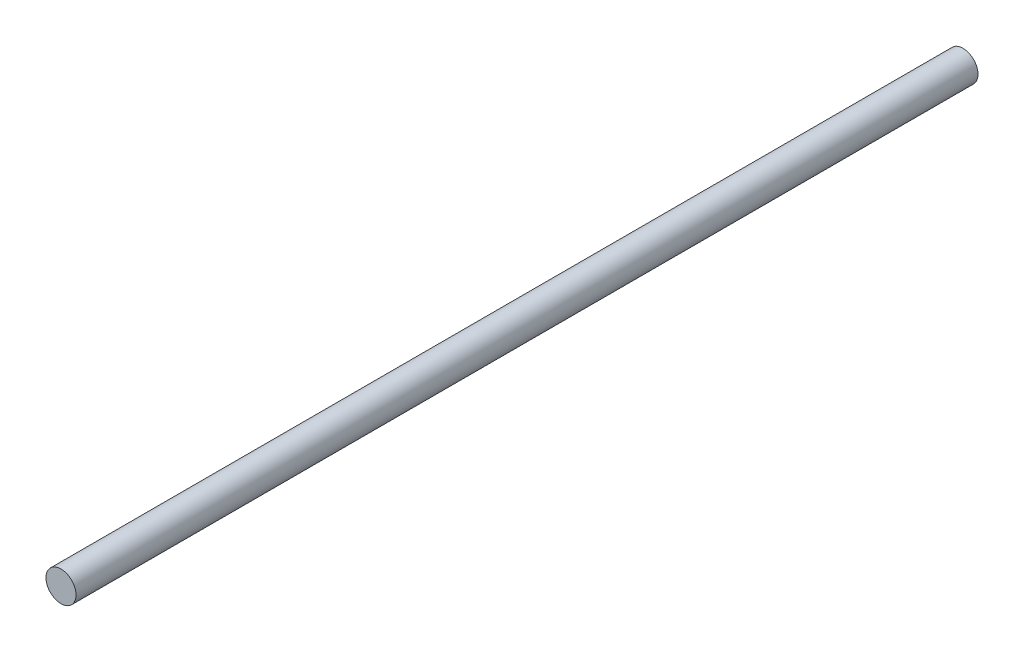
ISO-10303-21;
HEADER;
FILE_DESCRIPTION(('STEP AP214'),'2;1');
FILE_NAME('part.step','',(''),(''),'','','');
FILE_SCHEMA(('AUTOMOTIVE_DESIGN { 1 0 10303 214 1 1 1 1 }'));
ENDSEC;
DATA;
#1=APPLICATION_CONTEXT('core data for automotive mechanical design processes');
#2=APPLICATION_PROTOCOL_DEFINITION('international standard','automotive_design',2000,#1);
#3=PRODUCT_CONTEXT('',#1,'mechanical');
#4=PRODUCT('Part','Part','',(#3));
#5=PRODUCT_RELATED_PRODUCT_CATEGORY('part','',(#4));
#6=PRODUCT_DEFINITION_FORMATION('','',#4);
#7=PRODUCT_DEFINITION_CONTEXT('part definition',#1,'design');
#8=PRODUCT_DEFINITION('design','',#6,#7);
#9=PRODUCT_DEFINITION_SHAPE('','',#8);
#10=(LENGTH_UNIT() NAMED_UNIT(*) SI_UNIT(.MILLI.,.METRE.));
#11=(NAMED_UNIT(*) PLANE_ANGLE_UNIT() SI_UNIT($,.RADIAN.));
#12=(NAMED_UNIT(*) SI_UNIT($,.STERADIAN.) SOLID_ANGLE_UNIT());
#13=UNCERTAINTY_MEASURE_WITH_UNIT(LENGTH_MEASURE(1.E-05),#10,'distance_accuracy_value','');
#14=(GEOMETRIC_REPRESENTATION_CONTEXT(3) GLOBAL_UNCERTAINTY_ASSIGNED_CONTEXT((#13)) GLOBAL_UNIT_ASSIGNED_CONTEXT((#10,
#11,#12)) REPRESENTATION_CONTEXT('',''));
#15=CARTESIAN_POINT('',(0.,0.,0.));
#16=DIRECTION('',(0.,0.,1.));
#17=DIRECTION('',(1.,0.,0.));
#18=AXIS2_PLACEMENT_3D('',#15,#16,#17);
#19=CARTESIAN_POINT('',(0.,0.,90.));
#20=DIRECTION('',(0.,0.,-1.));
#21=DIRECTION('',(-1.,0.,0.));
#22=AXIS2_PLACEMENT_3D('',#19,#20,#21);
#23=CYLINDRICAL_SURFACE('',#22,1.5);
#24=CARTESIAN_POINT('',(0.,0.,90.));
#25=DIRECTION('',(0.,0.,1.));
#26=DIRECTION('',(1.,0.,0.));
#27=AXIS2_PLACEMENT_3D('',#24,#25,#26);
#28=CIRCLE('',#27,1.5);
#29=CARTESIAN_POINT('',(1.5,0.,90.));
#30=VERTEX_POINT('',#29);
#31=EDGE_CURVE('E10',#30,#30,#28,.T.);
#32=ORIENTED_EDGE('',*,*,#31,.F.);
#33=EDGE_LOOP('',(#32));
#34=FACE_BOUND('',#33,.T.);
#35=CARTESIAN_POINT('',(0.,0.,0.));
#36=DIRECTION('',(0.,0.,1.));
#37=DIRECTION('',(1.,0.,0.));
#38=AXIS2_PLACEMENT_3D('',#35,#36,#37);
#39=CIRCLE('',#38,1.5);
#40=CARTESIAN_POINT('',(1.5,0.,0.));
#41=VERTEX_POINT('',#40);
#42=EDGE_CURVE('E33',#41,#41,#39,.T.);
#43=ORIENTED_EDGE('',*,*,#42,.T.);
#44=EDGE_LOOP('',(#43));
#45=FACE_BOUND('',#44,.T.);
#46=ADVANCED_FACE('F30',(#34,#45),#23,.T.);
#47=CARTESIAN_POINT('',(0.,0.,90.));
#48=DIRECTION('',(0.,0.,1.));
#49=DIRECTION('',(1.,0.,0.));
#50=AXIS2_PLACEMENT_3D('',#47,#48,#49);
#51=PLANE('',#50);
#52=ORIENTED_EDGE('',*,*,#31,.T.);
#53=EDGE_LOOP('',(#52));
#54=FACE_BOUND('',#53,.T.);
#55=ADVANCED_FACE('F45',(#54),#51,.T.);
#56=CARTESIAN_POINT('',(0.,0.,0.));
#57=DIRECTION('',(0.,0.,1.));
#58=DIRECTION('',(1.,0.,0.));
#59=AXIS2_PLACEMENT_3D('',#56,#57,#58);
#60=PLANE('',#59);
#61=ORIENTED_EDGE('',*,*,#42,.F.);
#62=EDGE_LOOP('',(#61));
#63=FACE_BOUND('',#62,.T.);
#64=ADVANCED_FACE('F43',(#63),#60,.F.);
#65=CLOSED_SHELL('',(#46,#55,#64));
#66=MANIFOLD_SOLID_BREP('B2',#65);
#67=ADVANCED_BREP_SHAPE_REPRESENTATION('',(#18,#66),#14);
#68=SHAPE_DEFINITION_REPRESENTATION(#9,#67);
ENDSEC;
END-ISO-10303-21;
